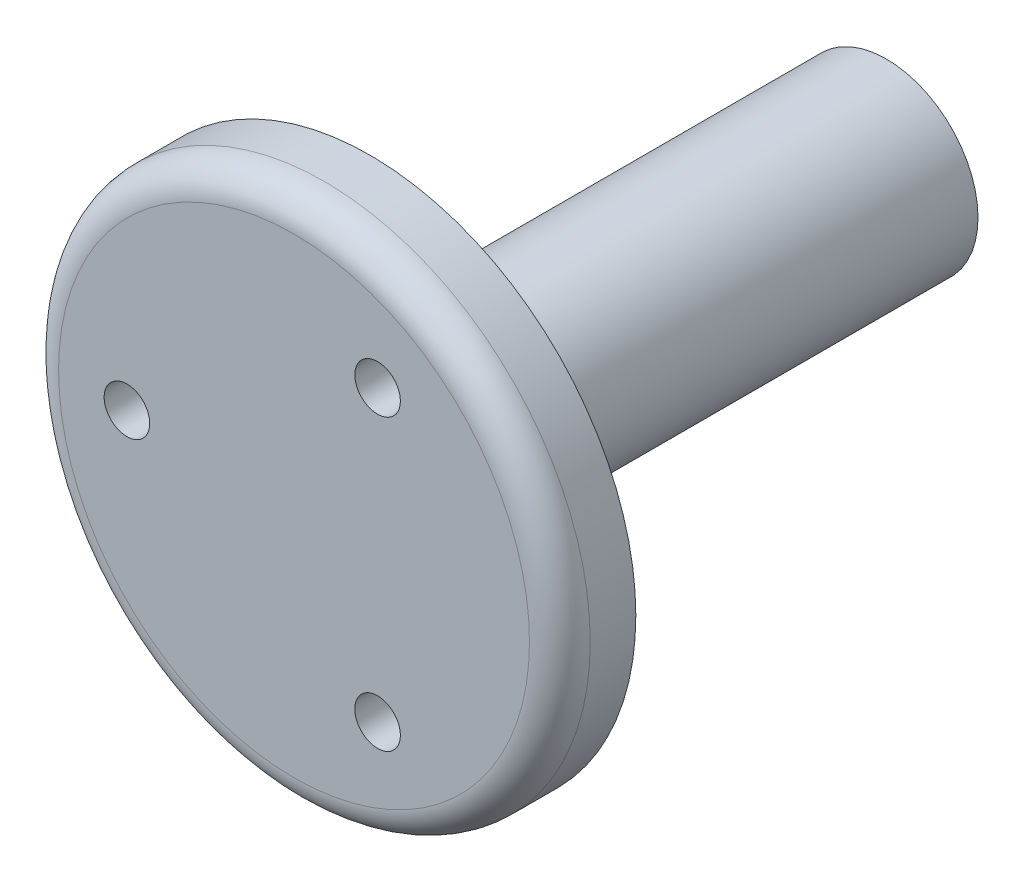
ISO-10303-21;
HEADER;
FILE_DESCRIPTION(('STEP AP214'),'2;1');
FILE_NAME('part.step','',(''),(''),'','','');
FILE_SCHEMA(('AUTOMOTIVE_DESIGN { 1 0 10303 214 1 1 1 1 }'));
ENDSEC;
DATA;
#1=APPLICATION_CONTEXT('core data for automotive mechanical design processes');
#2=APPLICATION_PROTOCOL_DEFINITION('international standard','automotive_design',2000,#1);
#3=PRODUCT_CONTEXT('',#1,'mechanical');
#4=PRODUCT('Part','Part','',(#3));
#5=PRODUCT_RELATED_PRODUCT_CATEGORY('part','',(#4));
#6=PRODUCT_DEFINITION_FORMATION('','',#4);
#7=PRODUCT_DEFINITION_CONTEXT('part definition',#1,'design');
#8=PRODUCT_DEFINITION('design','',#6,#7);
#9=PRODUCT_DEFINITION_SHAPE('','',#8);
#10=(LENGTH_UNIT() NAMED_UNIT(*) SI_UNIT(.MILLI.,.METRE.));
#11=(NAMED_UNIT(*) PLANE_ANGLE_UNIT() SI_UNIT($,.RADIAN.));
#12=(NAMED_UNIT(*) SI_UNIT($,.STERADIAN.) SOLID_ANGLE_UNIT());
#13=UNCERTAINTY_MEASURE_WITH_UNIT(LENGTH_MEASURE(1.E-05),#10,'distance_accuracy_value','');
#14=(GEOMETRIC_REPRESENTATION_CONTEXT(3) GLOBAL_UNCERTAINTY_ASSIGNED_CONTEXT((#13)) GLOBAL_UNIT_ASSIGNED_CONTEXT((#10,
#11,#12)) REPRESENTATION_CONTEXT('',''));
#15=CARTESIAN_POINT('',(0.,0.,0.));
#16=DIRECTION('',(0.,0.,1.));
#17=DIRECTION('',(1.,0.,0.));
#18=AXIS2_PLACEMENT_3D('',#15,#16,#17);
#19=CARTESIAN_POINT('',(0.,0.,34.));
#20=DIRECTION('',(0.,0.,-1.));
#21=DIRECTION('',(-1.,0.,0.));
#22=AXIS2_PLACEMENT_3D('',#19,#20,#21);
#23=CYLINDRICAL_SURFACE('',#22,6.025);
#24=CARTESIAN_POINT('',(0.,-6.025,4.5));
#25=CARTESIAN_POINT('',(0.0828872550337825,-6.02499859116748,4.4999976538995));
#26=CARTESIAN_POINT('',(0.165800786849744,-6.02327249950255,4.49310658800313));
#27=CARTESIAN_POINT('',(0.329252288578991,-6.01655401368184,4.46576523422343));
#28=CARTESIAN_POINT('',(0.409788872250885,-6.01155975137994,4.44530719111801));
#29=CARTESIAN_POINT('',(0.566102426100289,-5.99885806708042,4.39152840225331));
#30=CARTESIAN_POINT('',(0.641884960748519,-5.9911538895127,4.35822303328992));
#31=CARTESIAN_POINT('',(0.786787133638381,-5.97385325831286,4.27974892389461));
#32=CARTESIAN_POINT('',(0.855906560558073,-5.96425674469426,4.23457980737041));
#33=CARTESIAN_POINT('',(0.986933236577801,-5.9439943081781,4.13268522746104));
#34=CARTESIAN_POINT('',(1.04868490837687,-5.93331199594215,4.07576295541707));
#35=CARTESIAN_POINT('',(1.16187111176273,-5.91219103623551,3.95239928712266));
#36=CARTESIAN_POINT('',(1.21330448774849,-5.90175241617277,3.88595682608229));
#37=CARTESIAN_POINT('',(1.30512419623519,-5.88213563718997,3.74423286500587));
#38=CARTESIAN_POINT('',(1.34533678960091,-5.87297829185401,3.66883566074118));
#39=CARTESIAN_POINT('',(1.41245625361828,-5.8571997775479,3.51208666173158));
#40=CARTESIAN_POINT('',(1.43936523215882,-5.85057820683488,3.43073581265735));
#41=CARTESIAN_POINT('',(1.47858345652946,-5.84078935441607,3.26609870641288));
#42=CARTESIAN_POINT('',(1.49117228651338,-5.83755602397849,3.18288306712046));
#43=CARTESIAN_POINT('',(1.50226367140077,-5.83471201617127,3.01546301077977));
#44=CARTESIAN_POINT('',(1.50076849782139,-5.83510075462163,2.93125875536685));
#45=CARTESIAN_POINT('',(1.48395745353287,-5.839397575927,2.7663922102255));
#46=CARTESIAN_POINT('',(1.46897444143908,-5.84322089403257,2.6856934258288));
#47=CARTESIAN_POINT('',(1.42614388773027,-5.85382103430606,2.52799247642475));
#48=CARTESIAN_POINT('',(1.39829543640652,-5.8605980653276,2.45099057324711));
#49=CARTESIAN_POINT('',(1.33024009448831,-5.87642003332213,2.30197512682178));
#50=CARTESIAN_POINT('',(1.28991215014783,-5.88548701758094,2.23001930802538));
#51=CARTESIAN_POINT('',(1.19812726244859,-5.9048547875409,2.09377668225014));
#52=CARTESIAN_POINT('',(1.14666838651302,-5.9151557873558,2.02949121002483));
#53=CARTESIAN_POINT('',(1.03235686589153,-5.93618806681882,1.90850630271741));
#54=CARTESIAN_POINT('',(0.969223253300284,-5.94692327814197,1.8520726903302));
#55=CARTESIAN_POINT('',(0.83425989375813,-5.96735171193281,1.75054362359034));
#56=CARTESIAN_POINT('',(0.762429885585535,-5.97704490308387,1.70544850994792));
#57=CARTESIAN_POINT('',(0.611735374011842,-5.99434473447618,1.62778005086156));
#58=CARTESIAN_POINT('',(0.532847891415953,-6.00194420380702,1.59524958965088));
#59=CARTESIAN_POINT('',(0.37049283569613,-6.01414815334149,1.54398555947962));
#60=CARTESIAN_POINT('',(0.287026134444182,-6.01875320154438,1.52524937385121));
#61=CARTESIAN_POINT('',(0.120154954564742,-6.02436550321362,1.50251103181099));
#62=CARTESIAN_POINT('',(0.0368027081353532,-6.02546114009905,1.49814684006511));
#63=CARTESIAN_POINT('',(-0.129441114102538,-6.02418276028296,1.50328381340413));
#64=CARTESIAN_POINT('',(-0.212332730350848,-6.02180905315293,1.51278374138585));
#65=CARTESIAN_POINT('',(-0.374046306761291,-6.01391530708979,1.545080801254));
#66=CARTESIAN_POINT('',(-0.452910144756594,-6.0084419651424,1.56768069434763));
#67=CARTESIAN_POINT('',(-0.605723347624975,-5.99496568147754,1.62531108885092));
#68=CARTESIAN_POINT('',(-0.679672217685563,-5.98696248553344,1.66034283958921));
#69=CARTESIAN_POINT('',(-0.821998754937198,-5.96910233734336,1.74254600240078));
#70=CARTESIAN_POINT('',(-0.890255224813506,-5.95921519235318,1.78992053817629));
#71=CARTESIAN_POINT('',(-1.01797805834411,-5.93873193060506,1.8952045758279));
#72=CARTESIAN_POINT('',(-1.07744291507297,-5.92813569275623,1.95311587997173));
#73=CARTESIAN_POINT('',(-1.18738435638911,-5.90711080036238,2.07950987825253));
#74=CARTESIAN_POINT('',(-1.23760708653199,-5.89669249380407,2.14821547395467));
#75=CARTESIAN_POINT('',(-1.3258095911067,-5.87749091483707,2.29329328868649));
#76=CARTESIAN_POINT('',(-1.36378990995018,-5.86870756973012,2.36966516660374));
#77=CARTESIAN_POINT('',(-1.42614724749181,-5.85386683231566,2.52749715787085));
#78=CARTESIAN_POINT('',(-1.45060487106394,-5.84779333025972,2.60892383142243));
#79=CARTESIAN_POINT('',(-1.48543601433985,-5.83904387864131,2.77490742486483));
#80=CARTESIAN_POINT('',(-1.49581258377088,-5.83636719339172,2.85946366286614));
#81=CARTESIAN_POINT('',(-1.50202871540431,-5.834770182659,3.02672379939955));
#82=CARTESIAN_POINT('',(-1.49827388917588,-5.8357450434812,3.10941186510898));
#83=CARTESIAN_POINT('',(-1.47726136725296,-5.84109913470361,3.27293606252767));
#84=CARTESIAN_POINT('',(-1.46000393858062,-5.84547829778167,3.35377223082678));
#85=CARTESIAN_POINT('',(-1.41269676405681,-5.85708940199327,3.51086114907644));
#86=CARTESIAN_POINT('',(-1.38272249831309,-5.86430449233831,3.58713796085268));
#87=CARTESIAN_POINT('',(-1.31089234744519,-5.88077699173803,3.73363418578859));
#88=CARTESIAN_POINT('',(-1.26903482793603,-5.89003468168631,3.80385276398468));
#89=CARTESIAN_POINT('',(-1.17335214198049,-5.90984866967447,3.93820071381662));
#90=CARTESIAN_POINT('',(-1.11924526042355,-5.92043237742738,4.00212543889405));
#91=CARTESIAN_POINT('',(-1.00114952115637,-5.94154157158505,4.12012006311539));
#92=CARTESIAN_POINT('',(-0.937158323080797,-5.95206704358803,4.17418762169483));
#93=CARTESIAN_POINT('',(-0.79972646589074,-5.97209886183962,4.2718772715692));
#94=CARTESIAN_POINT('',(-0.726137025658205,-5.98158356612061,4.31529482442375));
#95=CARTESIAN_POINT('',(-0.572474544981368,-5.99823730155301,4.38907349399736));
#96=CARTESIAN_POINT('',(-0.492406228681642,-6.00540800129152,4.41944402394828));
#97=CARTESIAN_POINT('',(-0.343727044485851,-6.01555786049226,4.46172612110198));
#98=CARTESIAN_POINT('',(-0.275828137403205,-6.01907442729511,4.47604793469879));
#99=CARTESIAN_POINT('',(-0.138625543951495,-6.02379600073086,4.49518550381262));
#100=CARTESIAN_POINT('',(-0.0693219618244243,-6.02500117826358,4.50000196213868));
#101=CARTESIAN_POINT('',(0.,-6.025,4.5));
#102=B_SPLINE_CURVE_WITH_KNOTS('',3,(#24,#25,#26,#27,#28,#29,#30,#31,#32,#33,#34,#35,#36,#37,
#38,#39,#40,#41,#42,#43,#44,#45,#46,#47,#48,#49,#50,#51,#52,#53,#54,#55,#56,#57,#58,#59,#60,#61,
#62,#63,#64,#65,#66,#67,#68,#69,#70,#71,#72,#73,#74,#75,#76,#77,#78,#79,#80,#81,#82,#83,#84,#85,
#86,#87,#88,#89,#90,#91,#92,#93,#94,#95,#96,#97,#98,#99,#100,#101),.UNSPECIFIED.,.T.,.F.,(4,2,2,
2,2,2,2,2,2,2,2,2,2,2,2,2,2,2,2,2,2,2,2,2,2,2,2,2,2,2,2,2,2,2,2,2,2,2,4),(0.,0.248407736081311,
0.496957590749239,0.745210877801462,0.993472035673214,1.24628776132302,1.49913178536847,
1.75569731421543,2.01222217854392,2.26364777823424,2.5150328278224,2.76037919569439,
3.00574291454073,3.25356555587029,3.50143125929753,3.75630388166518,4.01118416177806,
4.2669268408128,4.52262099492307,4.77182276550197,5.0210023010266,5.26652409053501,
5.51207056053071,5.76194578810563,6.01186379598358,6.26786167012396,6.52384815864349,
6.77829186705611,7.0326804583005,7.27982380441599,7.52696226324547,7.772653926319,
8.01837939742783,8.27046493326648,8.52261024857274,8.77927386837317,9.03575199693602,
9.24352079030184,9.45127422103739),.UNSPECIFIED.);
#103=CARTESIAN_POINT('',(0.,-6.025,4.5));
#104=VERTEX_POINT('',#103);
#105=EDGE_CURVE('E84',#104,#104,#102,.T.);
#106=ORIENTED_EDGE('',*,*,#105,.T.);
#107=EDGE_LOOP('',(#106));
#108=FACE_BOUND('',#107,.T.);
#109=CARTESIAN_POINT('',(0.,0.,34.));
#110=DIRECTION('',(0.,0.,1.));
#111=DIRECTION('',(1.,0.,0.));
#112=AXIS2_PLACEMENT_3D('',#109,#110,#111);
#113=CIRCLE('',#112,6.025);
#114=CARTESIAN_POINT('',(6.025,0.,34.));
#115=VERTEX_POINT('',#114);
#116=EDGE_CURVE('E113',#115,#115,#113,.T.);
#117=ORIENTED_EDGE('',*,*,#116,.F.);
#118=EDGE_LOOP('',(#117));
#119=FACE_BOUND('',#118,.T.);
#120=CARTESIAN_POINT('',(0.,0.,0.));
#121=DIRECTION('',(0.,0.,1.));
#122=DIRECTION('',(1.,0.,0.));
#123=AXIS2_PLACEMENT_3D('',#120,#121,#122);
#124=CIRCLE('',#123,6.025);
#125=CARTESIAN_POINT('',(6.025,0.,0.));
#126=VERTEX_POINT('',#125);
#127=EDGE_CURVE('E111',#126,#126,#124,.T.);
#128=ORIENTED_EDGE('',*,*,#127,.T.);
#129=EDGE_LOOP('',(#128));
#130=FACE_BOUND('',#129,.T.);
#131=ADVANCED_FACE('F38',(#108,#119,#130),#23,.T.);
#132=CARTESIAN_POINT('',(0.,0.,0.));
#133=DIRECTION('',(0.,0.,1.));
#134=DIRECTION('',(1.,0.,0.));
#135=AXIS2_PLACEMENT_3D('',#132,#133,#134);
#136=PLANE('',#135);
#137=DIRECTION('',(-1.,0.,0.));
#138=VECTOR('',#137,1.);
#139=CARTESIAN_POINT('',(-1.52538519725347,-2.56,0.));
#140=LINE('',#139,#138);
#141=CARTESIAN_POINT('',(1.52538519725347,-2.56,0.));
#142=VERTEX_POINT('',#141);
#143=CARTESIAN_POINT('',(-1.52538519725347,-2.56,0.));
#144=VERTEX_POINT('',#143);
#145=EDGE_CURVE('E76',#142,#144,#140,.T.);
#146=ORIENTED_EDGE('',*,*,#145,.F.);
#147=CARTESIAN_POINT('',(0.,-0.000949928422213329,0.));
#148=DIRECTION('',(0.,0.,-1.));
#149=DIRECTION('',(-1.,0.,0.));
#150=AXIS2_PLACEMENT_3D('',#147,#148,#149);
#151=CIRCLE('',#150,2.97918399378794);
#152=EDGE_CURVE('E55',#144,#142,#151,.T.);
#153=ORIENTED_EDGE('',*,*,#152,.F.);
#154=EDGE_LOOP('',(#146,#153));
#155=FACE_BOUND('',#154,.T.);
#156=ORIENTED_EDGE('',*,*,#127,.F.);
#157=EDGE_LOOP('',(#156));
#158=FACE_BOUND('',#157,.T.);
#159=ADVANCED_FACE('F81',(#155,#158),#136,.F.);
#160=CARTESIAN_POINT('',(0.,0.0467971030716008,39.));
#161=DIRECTION('',(0.,0.,-1.));
#162=DIRECTION('',(-1.,0.,0.));
#163=AXIS2_PLACEMENT_3D('',#160,#161,#162);
#164=CYLINDRICAL_SURFACE('',#163,17.5);
#165=CARTESIAN_POINT('',(0.,0.0467971030716008,37.));
#166=DIRECTION('',(0.,0.,1.));
#167=DIRECTION('',(1.,0.,0.));
#168=AXIS2_PLACEMENT_3D('',#165,#166,#167);
#169=CIRCLE('',#168,17.5);
#170=CARTESIAN_POINT('',(17.5,0.0467971030716008,37.));
#171=VERTEX_POINT('',#170);
#172=EDGE_CURVE('E11',#171,#171,#169,.F.);
#173=ORIENTED_EDGE('',*,*,#172,.T.);
#174=EDGE_LOOP('',(#173));
#175=FACE_BOUND('',#174,.T.);
#176=CARTESIAN_POINT('',(0.,0.0467971030716008,34.));
#177=DIRECTION('',(0.,0.,1.));
#178=DIRECTION('',(1.,0.,0.));
#179=AXIS2_PLACEMENT_3D('',#176,#177,#178);
#180=CIRCLE('',#179,17.5);
#181=CARTESIAN_POINT('',(17.5,0.0467971030716008,34.));
#182=VERTEX_POINT('',#181);
#183=EDGE_CURVE('E107',#182,#182,#180,.T.);
#184=ORIENTED_EDGE('',*,*,#183,.T.);
#185=EDGE_LOOP('',(#184));
#186=FACE_BOUND('',#185,.T.);
#187=ADVANCED_FACE('F154',(#175,#186),#164,.T.);
#188=CARTESIAN_POINT('',(0.,0.0467971030716008,39.));
#189=DIRECTION('',(0.,0.,1.));
#190=DIRECTION('',(1.,0.,0.));
#191=AXIS2_PLACEMENT_3D('',#188,#189,#190);
#192=PLANE('',#191);
#193=CARTESIAN_POINT('',(0.,0.0467971030716008,39.));
#194=DIRECTION('',(0.,0.,1.));
#195=DIRECTION('',(1.,0.,0.));
#196=AXIS2_PLACEMENT_3D('',#193,#194,#195);
#197=CIRCLE('',#196,15.5);
#198=CARTESIAN_POINT('',(15.5,0.0467971030716008,39.));
#199=VERTEX_POINT('',#198);
#200=EDGE_CURVE('E48',#199,#199,#197,.T.);
#201=ORIENTED_EDGE('',*,*,#200,.T.);
#202=EDGE_LOOP('',(#201));
#203=FACE_BOUND('',#202,.T.);
#204=CARTESIAN_POINT('',(-11.,0.,39.));
#205=DIRECTION('',(0.,0.,1.));
#206=DIRECTION('',(1.,0.,0.));
#207=AXIS2_PLACEMENT_3D('',#204,#205,#206);
#208=CIRCLE('',#207,1.5);
#209=CARTESIAN_POINT('',(-9.5,0.,39.));
#210=VERTEX_POINT('',#209);
#211=EDGE_CURVE('E95',#210,#210,#208,.T.);
#212=ORIENTED_EDGE('',*,*,#211,.F.);
#213=EDGE_LOOP('',(#212));
#214=FACE_BOUND('',#213,.T.);
#215=CARTESIAN_POINT('',(5.50000000000004,9.5262794416288,39.));
#216=DIRECTION('',(0.,0.,1.));
#217=DIRECTION('',(1.,0.,0.));
#218=AXIS2_PLACEMENT_3D('',#215,#216,#217);
#219=CIRCLE('',#218,1.5);
#220=CARTESIAN_POINT('',(7.00000000000005,9.5262794416288,39.));
#221=VERTEX_POINT('',#220);
#222=EDGE_CURVE('E100',#221,#221,#219,.T.);
#223=ORIENTED_EDGE('',*,*,#222,.F.);
#224=EDGE_LOOP('',(#223));
#225=FACE_BOUND('',#224,.T.);
#226=CARTESIAN_POINT('',(5.49999999999991,-9.52627944162887,39.));
#227=DIRECTION('',(0.,0.,1.));
#228=DIRECTION('',(1.,0.,0.));
#229=AXIS2_PLACEMENT_3D('',#226,#227,#228);
#230=CIRCLE('',#229,1.5);
#231=CARTESIAN_POINT('',(6.99999999999991,-9.52627944162887,39.));
#232=VERTEX_POINT('',#231);
#233=EDGE_CURVE('E72',#232,#232,#230,.T.);
#234=ORIENTED_EDGE('',*,*,#233,.F.);
#235=EDGE_LOOP('',(#234));
#236=FACE_BOUND('',#235,.T.);
#237=ADVANCED_FACE('F134',(#203,#214,#225,#236),#192,.T.);
#238=CARTESIAN_POINT('',(0.,0.0467971030716008,34.));
#239=DIRECTION('',(0.,0.,1.));
#240=DIRECTION('',(1.,0.,0.));
#241=AXIS2_PLACEMENT_3D('',#238,#239,#240);
#242=PLANE('',#241);
#243=CARTESIAN_POINT('',(-11.,0.,34.));
#244=DIRECTION('',(0.,0.,1.));
#245=DIRECTION('',(1.,0.,0.));
#246=AXIS2_PLACEMENT_3D('',#243,#244,#245);
#247=CIRCLE('',#246,1.5);
#248=CARTESIAN_POINT('',(-9.5,0.,34.));
#249=VERTEX_POINT('',#248);
#250=EDGE_CURVE('E112',#249,#249,#247,.T.);
#251=ORIENTED_EDGE('',*,*,#250,.T.);
#252=EDGE_LOOP('',(#251));
#253=FACE_BOUND('',#252,.T.);
#254=CARTESIAN_POINT('',(5.50000000000004,9.5262794416288,34.));
#255=DIRECTION('',(0.,0.,1.));
#256=DIRECTION('',(1.,0.,0.));
#257=AXIS2_PLACEMENT_3D('',#254,#255,#256);
#258=CIRCLE('',#257,1.5);
#259=CARTESIAN_POINT('',(7.00000000000005,9.5262794416288,34.));
#260=VERTEX_POINT('',#259);
#261=EDGE_CURVE('E123',#260,#260,#258,.T.);
#262=ORIENTED_EDGE('',*,*,#261,.T.);
#263=EDGE_LOOP('',(#262));
#264=FACE_BOUND('',#263,.T.);
#265=CARTESIAN_POINT('',(5.49999999999991,-9.52627944162887,34.));
#266=DIRECTION('',(0.,0.,1.));
#267=DIRECTION('',(1.,0.,0.));
#268=AXIS2_PLACEMENT_3D('',#265,#266,#267);
#269=CIRCLE('',#268,1.5);
#270=CARTESIAN_POINT('',(6.99999999999991,-9.52627944162887,34.));
#271=VERTEX_POINT('',#270);
#272=EDGE_CURVE('E99',#271,#271,#269,.T.);
#273=ORIENTED_EDGE('',*,*,#272,.T.);
#274=EDGE_LOOP('',(#273));
#275=FACE_BOUND('',#274,.T.);
#276=ORIENTED_EDGE('',*,*,#116,.T.);
#277=EDGE_LOOP('',(#276));
#278=FACE_BOUND('',#277,.T.);
#279=ORIENTED_EDGE('',*,*,#183,.F.);
#280=EDGE_LOOP('',(#279));
#281=FACE_BOUND('',#280,.T.);
#282=ADVANCED_FACE('F181',(#253,#264,#275,#278,#281),#242,.F.);
#283=CARTESIAN_POINT('',(5.49999999999991,-9.52627944162887,29.));
#284=DIRECTION('',(0.,0.,1.));
#285=DIRECTION('',(1.,0.,0.));
#286=AXIS2_PLACEMENT_3D('',#283,#284,#285);
#287=CYLINDRICAL_SURFACE('',#286,1.5);
#288=ORIENTED_EDGE('',*,*,#233,.T.);
#289=EDGE_LOOP('',(#288));
#290=FACE_BOUND('',#289,.T.);
#291=ORIENTED_EDGE('',*,*,#272,.F.);
#292=EDGE_LOOP('',(#291));
#293=FACE_BOUND('',#292,.T.);
#294=ADVANCED_FACE('F177',(#290,#293),#287,.F.);
#295=CARTESIAN_POINT('',(5.50000000000004,9.5262794416288,29.));
#296=DIRECTION('',(0.,0.,1.));
#297=DIRECTION('',(1.,0.,0.));
#298=AXIS2_PLACEMENT_3D('',#295,#296,#297);
#299=CYLINDRICAL_SURFACE('',#298,1.5);
#300=ORIENTED_EDGE('',*,*,#222,.T.);
#301=EDGE_LOOP('',(#300));
#302=FACE_BOUND('',#301,.T.);
#303=ORIENTED_EDGE('',*,*,#261,.F.);
#304=EDGE_LOOP('',(#303));
#305=FACE_BOUND('',#304,.T.);
#306=ADVANCED_FACE('F145',(#302,#305),#299,.F.);
#307=CARTESIAN_POINT('',(-11.,0.,29.));
#308=DIRECTION('',(0.,0.,1.));
#309=DIRECTION('',(1.,0.,0.));
#310=AXIS2_PLACEMENT_3D('',#307,#308,#309);
#311=CYLINDRICAL_SURFACE('',#310,1.5);
#312=ORIENTED_EDGE('',*,*,#211,.T.);
#313=EDGE_LOOP('',(#312));
#314=FACE_BOUND('',#313,.T.);
#315=ORIENTED_EDGE('',*,*,#250,.F.);
#316=EDGE_LOOP('',(#315));
#317=FACE_BOUND('',#316,.T.);
#318=ADVANCED_FACE('F138',(#314,#317),#311,.F.);
#319=CARTESIAN_POINT('',(0.,0.0467971030716008,37.));
#320=DIRECTION('',(0.,0.,1.));
#321=DIRECTION('',(1.,0.,0.));
#322=AXIS2_PLACEMENT_3D('',#319,#320,#321);
#323=TOROIDAL_SURFACE('',#322,15.5,2.);
#324=ORIENTED_EDGE('',*,*,#172,.F.);
#325=EDGE_LOOP('',(#324));
#326=FACE_BOUND('',#325,.T.);
#327=ORIENTED_EDGE('',*,*,#200,.F.);
#328=EDGE_LOOP('',(#327));
#329=FACE_BOUND('',#328,.T.);
#330=ADVANCED_FACE('F40',(#326,#329),#323,.T.);
#331=CARTESIAN_POINT('',(0.,-0.000949928422213329,15.));
#332=DIRECTION('',(0.,0.,-1.));
#333=DIRECTION('',(-1.,0.,0.));
#334=AXIS2_PLACEMENT_3D('',#331,#332,#333);
#335=CYLINDRICAL_SURFACE('',#334,2.97918399378794);
#336=ORIENTED_EDGE('',*,*,#152,.T.);
#337=DIRECTION('',(0.,0.,-1.));
#338=VECTOR('',#337,1.);
#339=CARTESIAN_POINT('',(1.52538519725347,-2.56,15.));
#340=LINE('',#339,#338);
#341=CARTESIAN_POINT('',(1.52538519725347,-2.56,15.));
#342=VERTEX_POINT('',#341);
#343=EDGE_CURVE('E73',#342,#142,#340,.T.);
#344=ORIENTED_EDGE('',*,*,#343,.F.);
#345=CARTESIAN_POINT('',(0.,-0.000949928422213329,15.));
#346=DIRECTION('',(0.,0.,-1.));
#347=DIRECTION('',(-1.,0.,0.));
#348=AXIS2_PLACEMENT_3D('',#345,#346,#347);
#349=CIRCLE('',#348,2.97918399378794);
#350=CARTESIAN_POINT('',(-1.52538519725347,-2.56,15.));
#351=VERTEX_POINT('',#350);
#352=EDGE_CURVE('E69',#351,#342,#349,.T.);
#353=ORIENTED_EDGE('',*,*,#352,.F.);
#354=DIRECTION('',(0.,0.,-1.));
#355=VECTOR('',#354,1.);
#356=CARTESIAN_POINT('',(-1.52538519725347,-2.56,15.));
#357=LINE('',#356,#355);
#358=EDGE_CURVE('E63',#351,#144,#357,.T.);
#359=ORIENTED_EDGE('',*,*,#358,.T.);
#360=EDGE_LOOP('',(#336,#344,#353,#359));
#361=FACE_BOUND('',#360,.T.);
#362=ADVANCED_FACE('F67',(#361),#335,.F.);
#363=CARTESIAN_POINT('',(-1.52538519725347,-2.56,15.));
#364=DIRECTION('',(0.,-1.,0.));
#365=DIRECTION('',(0.,0.,-1.));
#366=AXIS2_PLACEMENT_3D('',#363,#364,#365);
#367=PLANE('',#366);
#368=CARTESIAN_POINT('',(0.,-2.56,3.));
#369=DIRECTION('',(0.,-1.,0.));
#370=DIRECTION('',(0.,0.,-1.));
#371=AXIS2_PLACEMENT_3D('',#368,#369,#370);
#372=CIRCLE('',#371,1.5);
#373=CARTESIAN_POINT('',(0.,-2.56,1.5));
#374=VERTEX_POINT('',#373);
#375=EDGE_CURVE('E42',#374,#374,#372,.T.);
#376=ORIENTED_EDGE('',*,*,#375,.T.);
#377=EDGE_LOOP('',(#376));
#378=FACE_BOUND('',#377,.T.);
#379=ORIENTED_EDGE('',*,*,#145,.T.);
#380=ORIENTED_EDGE('',*,*,#358,.F.);
#381=DIRECTION('',(-1.,0.,0.));
#382=VECTOR('',#381,1.);
#383=CARTESIAN_POINT('',(-1.52538519725347,-2.56,15.));
#384=LINE('',#383,#382);
#385=EDGE_CURVE('E90',#342,#351,#384,.T.);
#386=ORIENTED_EDGE('',*,*,#385,.F.);
#387=ORIENTED_EDGE('',*,*,#343,.T.);
#388=EDGE_LOOP('',(#379,#380,#386,#387));
#389=FACE_BOUND('',#388,.T.);
#390=ADVANCED_FACE('F77',(#378,#389),#367,.F.);
#391=CARTESIAN_POINT('',(0.,-0.000949928422213329,15.));
#392=DIRECTION('',(0.,0.,-1.));
#393=DIRECTION('',(-1.,0.,0.));
#394=AXIS2_PLACEMENT_3D('',#391,#392,#393);
#395=PLANE('',#394);
#396=ORIENTED_EDGE('',*,*,#352,.T.);
#397=ORIENTED_EDGE('',*,*,#385,.T.);
#398=EDGE_LOOP('',(#396,#397));
#399=FACE_BOUND('',#398,.T.);
#400=ADVANCED_FACE('F167',(#399),#395,.T.);
#401=CARTESIAN_POINT('',(0.,-7.,3.));
#402=DIRECTION('',(0.,1.,0.));
#403=DIRECTION('',(0.,0.,1.));
#404=AXIS2_PLACEMENT_3D('',#401,#402,#403);
#405=CYLINDRICAL_SURFACE('',#404,1.5);
#406=ORIENTED_EDGE('',*,*,#375,.F.);
#407=EDGE_LOOP('',(#406));
#408=FACE_BOUND('',#407,.T.);
#409=ORIENTED_EDGE('',*,*,#105,.F.);
#410=EDGE_LOOP('',(#409));
#411=FACE_BOUND('',#410,.T.);
#412=ADVANCED_FACE('F163',(#408,#411),#405,.F.);
#413=CLOSED_SHELL('',(#131,#159,#187,#237,#282,#294,#306,#318,#330,#362,#390,#400,#412));
#414=MANIFOLD_SOLID_BREP('B2',#413);
#415=ADVANCED_BREP_SHAPE_REPRESENTATION('',(#18,#414),#14);
#416=SHAPE_DEFINITION_REPRESENTATION(#9,#415);
ENDSEC;
END-ISO-10303-21;
